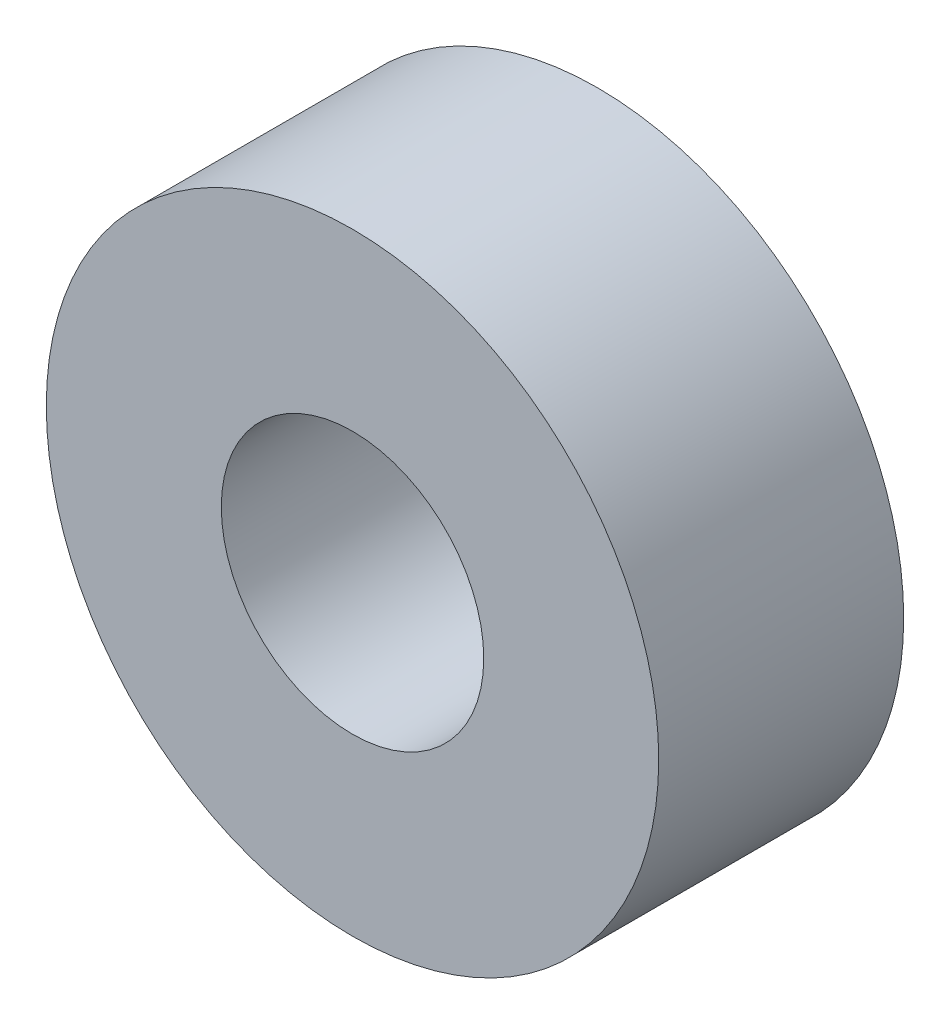
ISO-10303-21;
HEADER;
FILE_DESCRIPTION(('STEP AP214'),'2;1');
FILE_NAME('part.step','',(''),(''),'','','');
FILE_SCHEMA(('AUTOMOTIVE_DESIGN { 1 0 10303 214 1 1 1 1 }'));
ENDSEC;
DATA;
#1=APPLICATION_CONTEXT('core data for automotive mechanical design processes');
#2=APPLICATION_PROTOCOL_DEFINITION('international standard','automotive_design',2000,#1);
#3=PRODUCT_CONTEXT('',#1,'mechanical');
#4=PRODUCT('Part','Part','',(#3));
#5=PRODUCT_RELATED_PRODUCT_CATEGORY('part','',(#4));
#6=PRODUCT_DEFINITION_FORMATION('','',#4);
#7=PRODUCT_DEFINITION_CONTEXT('part definition',#1,'design');
#8=PRODUCT_DEFINITION('design','',#6,#7);
#9=PRODUCT_DEFINITION_SHAPE('','',#8);
#10=(LENGTH_UNIT() NAMED_UNIT(*) SI_UNIT(.MILLI.,.METRE.));
#11=(NAMED_UNIT(*) PLANE_ANGLE_UNIT() SI_UNIT($,.RADIAN.));
#12=(NAMED_UNIT(*) SI_UNIT($,.STERADIAN.) SOLID_ANGLE_UNIT());
#13=UNCERTAINTY_MEASURE_WITH_UNIT(LENGTH_MEASURE(1.E-05),#10,'distance_accuracy_value','');
#14=(GEOMETRIC_REPRESENTATION_CONTEXT(3) GLOBAL_UNCERTAINTY_ASSIGNED_CONTEXT((#13)) GLOBAL_UNIT_ASSIGNED_CONTEXT((#10,
#11,#12)) REPRESENTATION_CONTEXT('',''));
#15=CARTESIAN_POINT('',(0.,0.,0.));
#16=DIRECTION('',(0.,0.,1.));
#17=DIRECTION('',(1.,0.,0.));
#18=AXIS2_PLACEMENT_3D('',#15,#16,#17);
#19=CARTESIAN_POINT('',(0.,0.,14.));
#20=DIRECTION('',(0.,0.,1.));
#21=DIRECTION('',(1.,0.,0.));
#22=AXIS2_PLACEMENT_3D('',#19,#20,#21);
#23=PLANE('',#22);
#24=CARTESIAN_POINT('',(0.,0.,14.));
#25=DIRECTION('',(0.,0.,1.));
#26=DIRECTION('',(1.,0.,0.));
#27=AXIS2_PLACEMENT_3D('',#24,#25,#26);
#28=CIRCLE('',#27,17.5);
#29=CARTESIAN_POINT('',(17.5,0.,14.));
#30=VERTEX_POINT('',#29);
#31=EDGE_CURVE('E10',#30,#30,#28,.T.);
#32=ORIENTED_EDGE('',*,*,#31,.T.);
#33=EDGE_LOOP('',(#32));
#34=FACE_BOUND('',#33,.T.);
#35=CARTESIAN_POINT('',(0.,0.,14.));
#36=DIRECTION('',(0.,0.,1.));
#37=DIRECTION('',(1.,0.,0.));
#38=AXIS2_PLACEMENT_3D('',#35,#36,#37);
#39=CIRCLE('',#38,7.5);
#40=CARTESIAN_POINT('',(7.5,0.,14.));
#41=VERTEX_POINT('',#40);
#42=EDGE_CURVE('E42',#41,#41,#39,.T.);
#43=ORIENTED_EDGE('',*,*,#42,.F.);
#44=EDGE_LOOP('',(#43));
#45=FACE_BOUND('',#44,.T.);
#46=ADVANCED_FACE('F31',(#34,#45),#23,.T.);
#47=CARTESIAN_POINT('',(0.,0.,0.));
#48=DIRECTION('',(0.,0.,1.));
#49=DIRECTION('',(1.,0.,0.));
#50=AXIS2_PLACEMENT_3D('',#47,#48,#49);
#51=PLANE('',#50);
#52=CARTESIAN_POINT('',(0.,0.,0.));
#53=DIRECTION('',(0.,0.,1.));
#54=DIRECTION('',(1.,0.,0.));
#55=AXIS2_PLACEMENT_3D('',#52,#53,#54);
#56=CIRCLE('',#55,17.5);
#57=CARTESIAN_POINT('',(17.5,0.,0.));
#58=VERTEX_POINT('',#57);
#59=EDGE_CURVE('E35',#58,#58,#56,.T.);
#60=ORIENTED_EDGE('',*,*,#59,.F.);
#61=EDGE_LOOP('',(#60));
#62=FACE_BOUND('',#61,.T.);
#63=CARTESIAN_POINT('',(0.,0.,0.));
#64=DIRECTION('',(0.,0.,1.));
#65=DIRECTION('',(1.,0.,0.));
#66=AXIS2_PLACEMENT_3D('',#63,#64,#65);
#67=CIRCLE('',#66,7.5);
#68=CARTESIAN_POINT('',(7.5,0.,0.));
#69=VERTEX_POINT('',#68);
#70=EDGE_CURVE('E44',#69,#69,#67,.T.);
#71=ORIENTED_EDGE('',*,*,#70,.T.);
#72=EDGE_LOOP('',(#71));
#73=FACE_BOUND('',#72,.T.);
#74=ADVANCED_FACE('F54',(#62,#73),#51,.F.);
#75=CARTESIAN_POINT('',(0.,0.,14.));
#76=DIRECTION('',(0.,0.,-1.));
#77=DIRECTION('',(-1.,0.,0.));
#78=AXIS2_PLACEMENT_3D('',#75,#76,#77);
#79=CYLINDRICAL_SURFACE('',#78,17.5);
#80=ORIENTED_EDGE('',*,*,#31,.F.);
#81=EDGE_LOOP('',(#80));
#82=FACE_BOUND('',#81,.T.);
#83=ORIENTED_EDGE('',*,*,#59,.T.);
#84=EDGE_LOOP('',(#83));
#85=FACE_BOUND('',#84,.T.);
#86=ADVANCED_FACE('F33',(#82,#85),#79,.T.);
#87=CARTESIAN_POINT('',(0.,0.,14.));
#88=DIRECTION('',(0.,0.,-1.));
#89=DIRECTION('',(-1.,0.,0.));
#90=AXIS2_PLACEMENT_3D('',#87,#88,#89);
#91=CYLINDRICAL_SURFACE('',#90,7.5);
#92=ORIENTED_EDGE('',*,*,#42,.T.);
#93=EDGE_LOOP('',(#92));
#94=FACE_BOUND('',#93,.T.);
#95=ORIENTED_EDGE('',*,*,#70,.F.);
#96=EDGE_LOOP('',(#95));
#97=FACE_BOUND('',#96,.T.);
#98=ADVANCED_FACE('F50',(#94,#97),#91,.F.);
#99=CLOSED_SHELL('',(#46,#74,#86,#98));
#100=MANIFOLD_SOLID_BREP('B2',#99);
#101=ADVANCED_BREP_SHAPE_REPRESENTATION('',(#18,#100),#14);
#102=SHAPE_DEFINITION_REPRESENTATION(#9,#101);
ENDSEC;
END-ISO-10303-21;
